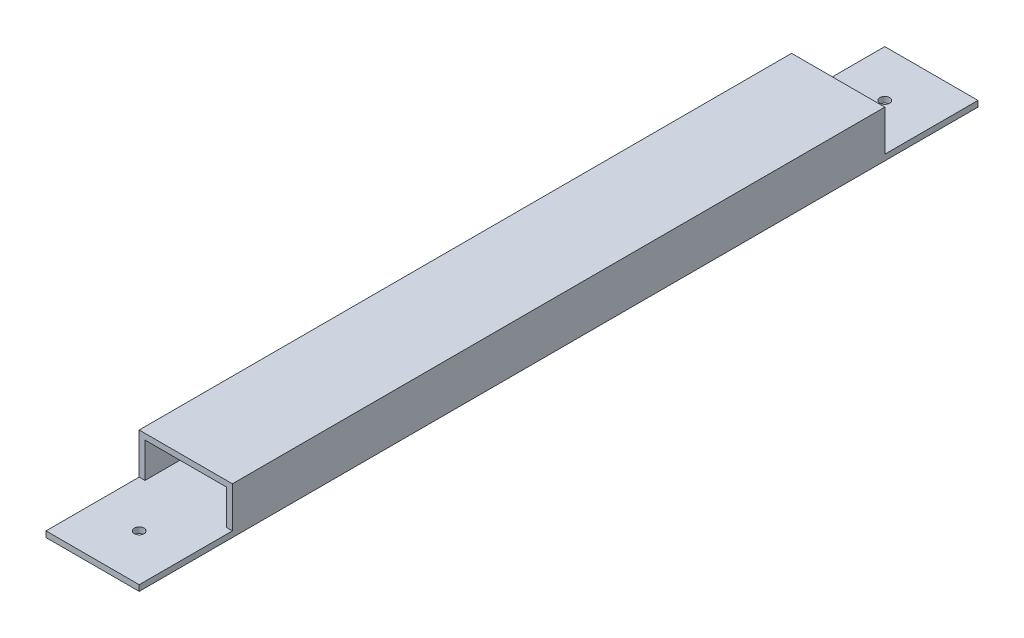
ISO-10303-21;
HEADER;
FILE_DESCRIPTION(('STEP AP214'),'2;1');
FILE_NAME('part.step','',(''),(''),'','','');
FILE_SCHEMA(('AUTOMOTIVE_DESIGN { 1 0 10303 214 1 1 1 1 }'));
ENDSEC;
DATA;
#1=APPLICATION_CONTEXT('core data for automotive mechanical design processes');
#2=APPLICATION_PROTOCOL_DEFINITION('international standard','automotive_design',2000,#1);
#3=PRODUCT_CONTEXT('',#1,'mechanical');
#4=PRODUCT('Part','Part','',(#3));
#5=PRODUCT_RELATED_PRODUCT_CATEGORY('part','',(#4));
#6=PRODUCT_DEFINITION_FORMATION('','',#4);
#7=PRODUCT_DEFINITION_CONTEXT('part definition',#1,'design');
#8=PRODUCT_DEFINITION('design','',#6,#7);
#9=PRODUCT_DEFINITION_SHAPE('','',#8);
#10=(LENGTH_UNIT() NAMED_UNIT(*) SI_UNIT(.MILLI.,.METRE.));
#11=(NAMED_UNIT(*) PLANE_ANGLE_UNIT() SI_UNIT($,.RADIAN.));
#12=(NAMED_UNIT(*) SI_UNIT($,.STERADIAN.) SOLID_ANGLE_UNIT());
#13=UNCERTAINTY_MEASURE_WITH_UNIT(LENGTH_MEASURE(1.E-05),#10,'distance_accuracy_value','');
#14=(GEOMETRIC_REPRESENTATION_CONTEXT(3) GLOBAL_UNCERTAINTY_ASSIGNED_CONTEXT((#13)) GLOBAL_UNIT_ASSIGNED_CONTEXT((#10,
#11,#12)) REPRESENTATION_CONTEXT('',''));
#15=CARTESIAN_POINT('',(0.,0.,0.));
#16=DIRECTION('',(0.,0.,1.));
#17=DIRECTION('',(1.,0.,0.));
#18=AXIS2_PLACEMENT_3D('',#15,#16,#17);
#19=CARTESIAN_POINT('',(0.,0.,457.2));
#20=DIRECTION('',(0.,0.,-1.));
#21=DIRECTION('',(-1.,0.,0.));
#22=AXIS2_PLACEMENT_3D('',#19,#20,#21);
#23=PLANE('',#22);
#24=DIRECTION('',(1.,0.,0.));
#25=VECTOR('',#24,1.);
#26=CARTESIAN_POINT('',(-22.225,-9.525,457.2));
#27=LINE('',#26,#25);
#28=CARTESIAN_POINT('',(-25.4,-9.52499999999999,457.2));
#29=VERTEX_POINT('',#28);
#30=CARTESIAN_POINT('',(25.4,-9.52499999999999,457.2));
#31=VERTEX_POINT('',#30);
#32=EDGE_CURVE('E219',#29,#31,#27,.T.);
#33=ORIENTED_EDGE('',*,*,#32,.F.);
#34=DIRECTION('',(0.,-1.,0.));
#35=VECTOR('',#34,1.);
#36=CARTESIAN_POINT('',(-25.4,-12.7,457.2));
#37=LINE('',#36,#35);
#38=CARTESIAN_POINT('',(-25.4,-12.7,457.2));
#39=VERTEX_POINT('',#38);
#40=EDGE_CURVE('E200',#29,#39,#37,.T.);
#41=ORIENTED_EDGE('',*,*,#40,.T.);
#42=DIRECTION('',(1.,0.,0.));
#43=VECTOR('',#42,1.);
#44=CARTESIAN_POINT('',(-25.4,-12.7,457.2));
#45=LINE('',#44,#43);
#46=CARTESIAN_POINT('',(25.4,-12.7,457.2));
#47=VERTEX_POINT('',#46);
#48=EDGE_CURVE('E186',#39,#47,#45,.T.);
#49=ORIENTED_EDGE('',*,*,#48,.T.);
#50=DIRECTION('',(0.,1.,0.));
#51=VECTOR('',#50,1.);
#52=CARTESIAN_POINT('',(25.4,-12.7,457.2));
#53=LINE('',#52,#51);
#54=EDGE_CURVE('E190',#47,#31,#53,.T.);
#55=ORIENTED_EDGE('',*,*,#54,.T.);
#56=EDGE_LOOP('',(#33,#41,#49,#55));
#57=FACE_BOUND('',#56,.T.);
#58=ADVANCED_FACE('F38',(#57),#23,.F.);
#59=CARTESIAN_POINT('',(0.,0.,0.));
#60=DIRECTION('',(0.,0.,-1.));
#61=DIRECTION('',(-1.,0.,0.));
#62=AXIS2_PLACEMENT_3D('',#59,#60,#61);
#63=PLANE('',#62);
#64=DIRECTION('',(0.,-1.,0.));
#65=VECTOR('',#64,1.);
#66=CARTESIAN_POINT('',(-25.4,-12.7,0.));
#67=LINE('',#66,#65);
#68=CARTESIAN_POINT('',(-25.4,-9.52499999999999,0.));
#69=VERTEX_POINT('',#68);
#70=CARTESIAN_POINT('',(-25.4,-12.7,0.));
#71=VERTEX_POINT('',#70);
#72=EDGE_CURVE('E191',#69,#71,#67,.T.);
#73=ORIENTED_EDGE('',*,*,#72,.F.);
#74=DIRECTION('',(1.,0.,0.));
#75=VECTOR('',#74,1.);
#76=CARTESIAN_POINT('',(-22.225,-9.525,0.));
#77=LINE('',#76,#75);
#78=CARTESIAN_POINT('',(25.4,-9.52499999999999,0.));
#79=VERTEX_POINT('',#78);
#80=EDGE_CURVE('E220',#69,#79,#77,.T.);
#81=ORIENTED_EDGE('',*,*,#80,.T.);
#82=DIRECTION('',(0.,1.,0.));
#83=VECTOR('',#82,1.);
#84=CARTESIAN_POINT('',(25.4,-12.7,0.));
#85=LINE('',#84,#83);
#86=CARTESIAN_POINT('',(25.4,-12.7,0.));
#87=VERTEX_POINT('',#86);
#88=EDGE_CURVE('E194',#87,#79,#85,.T.);
#89=ORIENTED_EDGE('',*,*,#88,.F.);
#90=DIRECTION('',(1.,0.,0.));
#91=VECTOR('',#90,1.);
#92=CARTESIAN_POINT('',(-25.4,-12.7,0.));
#93=LINE('',#92,#91);
#94=EDGE_CURVE('E187',#71,#87,#93,.T.);
#95=ORIENTED_EDGE('',*,*,#94,.F.);
#96=EDGE_LOOP('',(#73,#81,#89,#95));
#97=FACE_BOUND('',#96,.T.);
#98=ADVANCED_FACE('F285',(#97),#63,.T.);
#99=CARTESIAN_POINT('',(25.4,-12.7,457.2));
#100=DIRECTION('',(-1.,0.,0.));
#101=DIRECTION('',(0.,0.,1.));
#102=AXIS2_PLACEMENT_3D('',#99,#100,#101);
#103=PLANE('',#102);
#104=DIRECTION('',(0.,0.,-1.));
#105=VECTOR('',#104,1.);
#106=CARTESIAN_POINT('',(25.4,12.7,457.2));
#107=LINE('',#106,#105);
#108=CARTESIAN_POINT('',(25.4,12.7,406.4));
#109=VERTEX_POINT('',#108);
#110=CARTESIAN_POINT('',(25.4,12.7,50.8));
#111=VERTEX_POINT('',#110);
#112=EDGE_CURVE('E161',#109,#111,#107,.T.);
#113=ORIENTED_EDGE('',*,*,#112,.F.);
#114=DIRECTION('',(0.,1.,0.));
#115=VECTOR('',#114,1.);
#116=CARTESIAN_POINT('',(25.4,-81.3670489685532,406.4));
#117=LINE('',#116,#115);
#118=CARTESIAN_POINT('',(25.4,-9.52499999999999,406.4));
#119=VERTEX_POINT('',#118);
#120=EDGE_CURVE('E141',#119,#109,#117,.T.);
#121=ORIENTED_EDGE('',*,*,#120,.F.);
#122=DIRECTION('',(0.,0.,1.));
#123=VECTOR('',#122,1.);
#124=CARTESIAN_POINT('',(25.4,-9.52499999999999,457.2));
#125=LINE('',#124,#123);
#126=EDGE_CURVE('E264',#119,#31,#125,.T.);
#127=ORIENTED_EDGE('',*,*,#126,.T.);
#128=ORIENTED_EDGE('',*,*,#54,.F.);
#129=DIRECTION('',(0.,0.,-1.));
#130=VECTOR('',#129,1.);
#131=CARTESIAN_POINT('',(25.4,-12.7,457.2));
#132=LINE('',#131,#130);
#133=EDGE_CURVE('E182',#47,#87,#132,.T.);
#134=ORIENTED_EDGE('',*,*,#133,.T.);
#135=ORIENTED_EDGE('',*,*,#88,.T.);
#136=DIRECTION('',(0.,0.,1.));
#137=VECTOR('',#136,1.);
#138=CARTESIAN_POINT('',(25.4,-9.52499999999999,0.));
#139=LINE('',#138,#137);
#140=CARTESIAN_POINT('',(25.4,-9.52499999999999,50.8));
#141=VERTEX_POINT('',#140);
#142=EDGE_CURVE('E255',#79,#141,#139,.T.);
#143=ORIENTED_EDGE('',*,*,#142,.T.);
#144=DIRECTION('',(0.,1.,0.));
#145=VECTOR('',#144,1.);
#146=CARTESIAN_POINT('',(25.4,-81.3670489685532,50.8));
#147=LINE('',#146,#145);
#148=EDGE_CURVE('E169',#141,#111,#147,.T.);
#149=ORIENTED_EDGE('',*,*,#148,.T.);
#150=EDGE_LOOP('',(#113,#121,#127,#128,#134,#135,#143,#149));
#151=FACE_BOUND('',#150,.T.);
#152=ADVANCED_FACE('F40',(#151),#103,.F.);
#153=CARTESIAN_POINT('',(-25.4,12.7,457.2));
#154=DIRECTION('',(0.,-1.,0.));
#155=DIRECTION('',(0.,0.,-1.));
#156=AXIS2_PLACEMENT_3D('',#153,#154,#155);
#157=PLANE('',#156);
#158=DIRECTION('',(0.,0.,-1.));
#159=VECTOR('',#158,1.);
#160=CARTESIAN_POINT('',(-25.4,12.7,457.2));
#161=LINE('',#160,#159);
#162=CARTESIAN_POINT('',(-25.4,12.7,406.4));
#163=VERTEX_POINT('',#162);
#164=CARTESIAN_POINT('',(-25.4,12.7,50.8));
#165=VERTEX_POINT('',#164);
#166=EDGE_CURVE('E163',#163,#165,#161,.T.);
#167=ORIENTED_EDGE('',*,*,#166,.F.);
#168=DIRECTION('',(-1.,0.,0.));
#169=VECTOR('',#168,1.);
#170=CARTESIAN_POINT('',(-25.4,12.7,406.4));
#171=LINE('',#170,#169);
#172=EDGE_CURVE('E145',#109,#163,#171,.T.);
#173=ORIENTED_EDGE('',*,*,#172,.F.);
#174=ORIENTED_EDGE('',*,*,#112,.T.);
#175=DIRECTION('',(1.,0.,0.));
#176=VECTOR('',#175,1.);
#177=CARTESIAN_POINT('',(-25.4,12.7,50.8));
#178=LINE('',#177,#176);
#179=EDGE_CURVE('E253',#165,#111,#178,.T.);
#180=ORIENTED_EDGE('',*,*,#179,.F.);
#181=EDGE_LOOP('',(#167,#173,#174,#180));
#182=FACE_BOUND('',#181,.T.);
#183=ADVANCED_FACE('F159',(#182),#157,.F.);
#184=CARTESIAN_POINT('',(-25.4,-12.7,457.2));
#185=DIRECTION('',(1.,0.,0.));
#186=DIRECTION('',(0.,0.,-1.));
#187=AXIS2_PLACEMENT_3D('',#184,#185,#186);
#188=PLANE('',#187);
#189=DIRECTION('',(0.,0.,-1.));
#190=VECTOR('',#189,1.);
#191=CARTESIAN_POINT('',(-25.4,-9.52499999999999,457.2));
#192=LINE('',#191,#190);
#193=CARTESIAN_POINT('',(-25.4,-9.52499999999999,406.4));
#194=VERTEX_POINT('',#193);
#195=EDGE_CURVE('E246',#29,#194,#192,.T.);
#196=ORIENTED_EDGE('',*,*,#195,.T.);
#197=DIRECTION('',(0.,1.,0.));
#198=VECTOR('',#197,1.);
#199=CARTESIAN_POINT('',(-25.4,-81.3670489685532,406.4));
#200=LINE('',#199,#198);
#201=EDGE_CURVE('E154',#194,#163,#200,.T.);
#202=ORIENTED_EDGE('',*,*,#201,.T.);
#203=ORIENTED_EDGE('',*,*,#166,.T.);
#204=DIRECTION('',(0.,1.,0.));
#205=VECTOR('',#204,1.);
#206=CARTESIAN_POINT('',(-25.4,-81.3670489685532,50.8));
#207=LINE('',#206,#205);
#208=CARTESIAN_POINT('',(-25.4,-9.52499999999999,50.8));
#209=VERTEX_POINT('',#208);
#210=EDGE_CURVE('E250',#209,#165,#207,.T.);
#211=ORIENTED_EDGE('',*,*,#210,.F.);
#212=DIRECTION('',(0.,0.,-1.));
#213=VECTOR('',#212,1.);
#214=CARTESIAN_POINT('',(-25.4,-9.52499999999999,0.));
#215=LINE('',#214,#213);
#216=EDGE_CURVE('E258',#209,#69,#215,.T.);
#217=ORIENTED_EDGE('',*,*,#216,.T.);
#218=ORIENTED_EDGE('',*,*,#72,.T.);
#219=DIRECTION('',(0.,0.,-1.));
#220=VECTOR('',#219,1.);
#221=CARTESIAN_POINT('',(-25.4,-12.7,457.2));
#222=LINE('',#221,#220);
#223=EDGE_CURVE('E176',#39,#71,#222,.T.);
#224=ORIENTED_EDGE('',*,*,#223,.F.);
#225=ORIENTED_EDGE('',*,*,#40,.F.);
#226=EDGE_LOOP('',(#196,#202,#203,#211,#217,#218,#224,#225));
#227=FACE_BOUND('',#226,.T.);
#228=ADVANCED_FACE('F308',(#227),#188,.F.);
#229=CARTESIAN_POINT('',(-25.4,-12.7,457.2));
#230=DIRECTION('',(0.,1.,0.));
#231=DIRECTION('',(-1.,0.,0.));
#232=AXIS2_PLACEMENT_3D('',#229,#230,#231);
#233=PLANE('',#232);
#234=CARTESIAN_POINT('',(0.,-12.7,431.8));
#235=DIRECTION('',(0.,1.,0.));
#236=DIRECTION('',(0.,0.,1.));
#237=AXIS2_PLACEMENT_3D('',#234,#235,#236);
#238=CIRCLE('',#237,2.667);
#239=CARTESIAN_POINT('',(0.,-12.7,434.467));
#240=VERTEX_POINT('',#239);
#241=EDGE_CURVE('E231',#240,#240,#238,.T.);
#242=ORIENTED_EDGE('',*,*,#241,.T.);
#243=EDGE_LOOP('',(#242));
#244=FACE_BOUND('',#243,.T.);
#245=CARTESIAN_POINT('',(0.,-12.7,25.4));
#246=DIRECTION('',(0.,1.,0.));
#247=DIRECTION('',(0.,0.,1.));
#248=AXIS2_PLACEMENT_3D('',#245,#246,#247);
#249=CIRCLE('',#248,2.667);
#250=CARTESIAN_POINT('',(0.,-12.7,28.067));
#251=VERTEX_POINT('',#250);
#252=EDGE_CURVE('E232',#251,#251,#249,.T.);
#253=ORIENTED_EDGE('',*,*,#252,.T.);
#254=EDGE_LOOP('',(#253));
#255=FACE_BOUND('',#254,.T.);
#256=ORIENTED_EDGE('',*,*,#94,.T.);
#257=ORIENTED_EDGE('',*,*,#133,.F.);
#258=ORIENTED_EDGE('',*,*,#48,.F.);
#259=ORIENTED_EDGE('',*,*,#223,.T.);
#260=EDGE_LOOP('',(#256,#257,#258,#259));
#261=FACE_BOUND('',#260,.T.);
#262=ADVANCED_FACE('F280',(#244,#255,#261),#233,.F.);
#263=CARTESIAN_POINT('',(-22.225,-9.525,457.2));
#264=DIRECTION('',(1.,0.,0.));
#265=DIRECTION('',(0.,0.,-1.));
#266=AXIS2_PLACEMENT_3D('',#263,#264,#265);
#267=PLANE('',#266);
#268=DIRECTION('',(0.,1.,0.));
#269=VECTOR('',#268,1.);
#270=CARTESIAN_POINT('',(-22.225,-9.525,406.4));
#271=LINE('',#270,#269);
#272=CARTESIAN_POINT('',(-22.225,-9.52499999999999,406.4));
#273=VERTEX_POINT('',#272);
#274=CARTESIAN_POINT('',(-22.225,9.525,406.4));
#275=VERTEX_POINT('',#274);
#276=EDGE_CURVE('E53',#273,#275,#271,.T.);
#277=ORIENTED_EDGE('',*,*,#276,.F.);
#278=DIRECTION('',(0.,0.,-1.));
#279=VECTOR('',#278,1.);
#280=CARTESIAN_POINT('',(-22.225,-9.525,457.2));
#281=LINE('',#280,#279);
#282=CARTESIAN_POINT('',(-22.225,-9.52499999999999,50.8));
#283=VERTEX_POINT('',#282);
#284=EDGE_CURVE('E198',#273,#283,#281,.T.);
#285=ORIENTED_EDGE('',*,*,#284,.T.);
#286=DIRECTION('',(0.,-1.,0.));
#287=VECTOR('',#286,1.);
#288=CARTESIAN_POINT('',(-22.225,-9.525,50.8));
#289=LINE('',#288,#287);
#290=CARTESIAN_POINT('',(-22.225,9.525,50.8));
#291=VERTEX_POINT('',#290);
#292=EDGE_CURVE('E242',#291,#283,#289,.T.);
#293=ORIENTED_EDGE('',*,*,#292,.F.);
#294=DIRECTION('',(0.,0.,-1.));
#295=VECTOR('',#294,1.);
#296=CARTESIAN_POINT('',(-22.225,9.525,457.2));
#297=LINE('',#296,#295);
#298=EDGE_CURVE('E215',#275,#291,#297,.T.);
#299=ORIENTED_EDGE('',*,*,#298,.F.);
#300=EDGE_LOOP('',(#277,#285,#293,#299));
#301=FACE_BOUND('',#300,.T.);
#302=ADVANCED_FACE('F304',(#301),#267,.T.);
#303=CARTESIAN_POINT('',(-22.225,-9.525,457.2));
#304=DIRECTION('',(0.,1.,0.));
#305=DIRECTION('',(0.,0.,1.));
#306=AXIS2_PLACEMENT_3D('',#303,#304,#305);
#307=PLANE('',#306);
#308=ORIENTED_EDGE('',*,*,#284,.F.);
#309=DIRECTION('',(1.,0.,0.));
#310=VECTOR('',#309,1.);
#311=CARTESIAN_POINT('',(-25.4,-9.52499999999999,406.4));
#312=LINE('',#311,#310);
#313=EDGE_CURVE('E268',#194,#273,#312,.T.);
#314=ORIENTED_EDGE('',*,*,#313,.F.);
#315=ORIENTED_EDGE('',*,*,#195,.F.);
#316=ORIENTED_EDGE('',*,*,#32,.T.);
#317=ORIENTED_EDGE('',*,*,#126,.F.);
#318=CARTESIAN_POINT('',(22.225,-9.52499999999999,406.4));
#319=VERTEX_POINT('',#318);
#320=EDGE_CURVE('E148',#319,#119,#312,.T.);
#321=ORIENTED_EDGE('',*,*,#320,.F.);
#322=DIRECTION('',(0.,0.,-1.));
#323=VECTOR('',#322,1.);
#324=CARTESIAN_POINT('',(22.225,-9.525,457.2));
#325=LINE('',#324,#323);
#326=CARTESIAN_POINT('',(22.225,-9.52499999999999,50.8));
#327=VERTEX_POINT('',#326);
#328=EDGE_CURVE('E207',#319,#327,#325,.T.);
#329=ORIENTED_EDGE('',*,*,#328,.T.);
#330=DIRECTION('',(-1.,0.,0.));
#331=VECTOR('',#330,1.);
#332=CARTESIAN_POINT('',(-25.4,-9.52499999999999,50.8));
#333=LINE('',#332,#331);
#334=EDGE_CURVE('E165',#141,#327,#333,.T.);
#335=ORIENTED_EDGE('',*,*,#334,.F.);
#336=ORIENTED_EDGE('',*,*,#142,.F.);
#337=ORIENTED_EDGE('',*,*,#80,.F.);
#338=ORIENTED_EDGE('',*,*,#216,.F.);
#339=EDGE_CURVE('E249',#283,#209,#333,.T.);
#340=ORIENTED_EDGE('',*,*,#339,.F.);
#341=EDGE_LOOP('',(#308,#314,#315,#316,#317,#321,#329,#335,#336,#337,#338,#340));
#342=FACE_BOUND('',#341,.T.);
#343=CARTESIAN_POINT('',(0.,-9.525,25.4));
#344=DIRECTION('',(0.,1.,0.));
#345=DIRECTION('',(0.,0.,1.));
#346=AXIS2_PLACEMENT_3D('',#343,#344,#345);
#347=CIRCLE('',#346,2.667);
#348=CARTESIAN_POINT('',(0.,-9.525,28.067));
#349=VERTEX_POINT('',#348);
#350=EDGE_CURVE('E227',#349,#349,#347,.T.);
#351=ORIENTED_EDGE('',*,*,#350,.F.);
#352=EDGE_LOOP('',(#351));
#353=FACE_BOUND('',#352,.T.);
#354=CARTESIAN_POINT('',(0.,-9.525,431.8));
#355=DIRECTION('',(0.,1.,0.));
#356=DIRECTION('',(0.,0.,1.));
#357=AXIS2_PLACEMENT_3D('',#354,#355,#356);
#358=CIRCLE('',#357,2.667);
#359=CARTESIAN_POINT('',(0.,-9.525,434.467));
#360=VERTEX_POINT('',#359);
#361=EDGE_CURVE('E223',#360,#360,#358,.T.);
#362=ORIENTED_EDGE('',*,*,#361,.F.);
#363=EDGE_LOOP('',(#362));
#364=FACE_BOUND('',#363,.T.);
#365=ADVANCED_FACE('F290',(#342,#353,#364),#307,.T.);
#366=CARTESIAN_POINT('',(22.225,-9.525,457.2));
#367=DIRECTION('',(-1.,0.,0.));
#368=DIRECTION('',(0.,-1.,0.));
#369=AXIS2_PLACEMENT_3D('',#366,#367,#368);
#370=PLANE('',#369);
#371=DIRECTION('',(0.,-1.,0.));
#372=VECTOR('',#371,1.);
#373=CARTESIAN_POINT('',(22.225,-9.525,406.4));
#374=LINE('',#373,#372);
#375=CARTESIAN_POINT('',(22.225,9.525,406.4));
#376=VERTEX_POINT('',#375);
#377=EDGE_CURVE('E239',#376,#319,#374,.T.);
#378=ORIENTED_EDGE('',*,*,#377,.F.);
#379=DIRECTION('',(0.,0.,-1.));
#380=VECTOR('',#379,1.);
#381=CARTESIAN_POINT('',(22.225,9.525,457.2));
#382=LINE('',#381,#380);
#383=CARTESIAN_POINT('',(22.225,9.525,50.8));
#384=VERTEX_POINT('',#383);
#385=EDGE_CURVE('E211',#376,#384,#382,.T.);
#386=ORIENTED_EDGE('',*,*,#385,.T.);
#387=DIRECTION('',(0.,1.,0.));
#388=VECTOR('',#387,1.);
#389=CARTESIAN_POINT('',(22.225,-9.525,50.8));
#390=LINE('',#389,#388);
#391=EDGE_CURVE('E64',#327,#384,#390,.T.);
#392=ORIENTED_EDGE('',*,*,#391,.F.);
#393=ORIENTED_EDGE('',*,*,#328,.F.);
#394=EDGE_LOOP('',(#378,#386,#392,#393));
#395=FACE_BOUND('',#394,.T.);
#396=ADVANCED_FACE('F296',(#395),#370,.T.);
#397=CARTESIAN_POINT('',(-22.225,9.525,457.2));
#398=DIRECTION('',(0.,-1.,0.));
#399=DIRECTION('',(0.,0.,-1.));
#400=AXIS2_PLACEMENT_3D('',#397,#398,#399);
#401=PLANE('',#400);
#402=DIRECTION('',(1.,0.,0.));
#403=VECTOR('',#402,1.);
#404=CARTESIAN_POINT('',(-22.225,9.525,406.4));
#405=LINE('',#404,#403);
#406=EDGE_CURVE('E11',#275,#376,#405,.T.);
#407=ORIENTED_EDGE('',*,*,#406,.F.);
#408=ORIENTED_EDGE('',*,*,#298,.T.);
#409=DIRECTION('',(-1.,0.,0.));
#410=VECTOR('',#409,1.);
#411=CARTESIAN_POINT('',(-22.225,9.525,50.8));
#412=LINE('',#411,#410);
#413=EDGE_CURVE('E47',#384,#291,#412,.T.);
#414=ORIENTED_EDGE('',*,*,#413,.F.);
#415=ORIENTED_EDGE('',*,*,#385,.F.);
#416=EDGE_LOOP('',(#407,#408,#414,#415));
#417=FACE_BOUND('',#416,.T.);
#418=ADVANCED_FACE('F299',(#417),#401,.T.);
#419=CARTESIAN_POINT('',(0.,-12.7,25.4));
#420=DIRECTION('',(0.,1.,0.));
#421=DIRECTION('',(0.,0.,1.));
#422=AXIS2_PLACEMENT_3D('',#419,#420,#421);
#423=CYLINDRICAL_SURFACE('',#422,2.667);
#424=ORIENTED_EDGE('',*,*,#350,.T.);
#425=EDGE_LOOP('',(#424));
#426=FACE_BOUND('',#425,.T.);
#427=ORIENTED_EDGE('',*,*,#252,.F.);
#428=EDGE_LOOP('',(#427));
#429=FACE_BOUND('',#428,.T.);
#430=ADVANCED_FACE('F332',(#426,#429),#423,.F.);
#431=CARTESIAN_POINT('',(0.,-12.7,431.8));
#432=DIRECTION('',(0.,1.,0.));
#433=DIRECTION('',(0.,0.,1.));
#434=AXIS2_PLACEMENT_3D('',#431,#432,#433);
#435=CYLINDRICAL_SURFACE('',#434,2.667);
#436=ORIENTED_EDGE('',*,*,#361,.T.);
#437=EDGE_LOOP('',(#436));
#438=FACE_BOUND('',#437,.T.);
#439=ORIENTED_EDGE('',*,*,#241,.F.);
#440=EDGE_LOOP('',(#439));
#441=FACE_BOUND('',#440,.T.);
#442=ADVANCED_FACE('F335',(#438,#441),#435,.F.);
#443=CARTESIAN_POINT('',(-25.4,-81.3670489685532,50.8));
#444=DIRECTION('',(0.,0.,1.));
#445=DIRECTION('',(1.,0.,0.));
#446=AXIS2_PLACEMENT_3D('',#443,#444,#445);
#447=PLANE('',#446);
#448=ORIENTED_EDGE('',*,*,#292,.T.);
#449=ORIENTED_EDGE('',*,*,#339,.T.);
#450=ORIENTED_EDGE('',*,*,#210,.T.);
#451=ORIENTED_EDGE('',*,*,#179,.T.);
#452=ORIENTED_EDGE('',*,*,#148,.F.);
#453=ORIENTED_EDGE('',*,*,#334,.T.);
#454=ORIENTED_EDGE('',*,*,#391,.T.);
#455=ORIENTED_EDGE('',*,*,#413,.T.);
#456=EDGE_LOOP('',(#448,#449,#450,#451,#452,#453,#454,#455));
#457=FACE_BOUND('',#456,.T.);
#458=ADVANCED_FACE('F293',(#457),#447,.F.);
#459=CARTESIAN_POINT('',(-25.4,-81.3670489685532,406.4));
#460=DIRECTION('',(0.,0.,-1.));
#461=DIRECTION('',(-1.,0.,0.));
#462=AXIS2_PLACEMENT_3D('',#459,#460,#461);
#463=PLANE('',#462);
#464=ORIENTED_EDGE('',*,*,#276,.T.);
#465=ORIENTED_EDGE('',*,*,#406,.T.);
#466=ORIENTED_EDGE('',*,*,#377,.T.);
#467=ORIENTED_EDGE('',*,*,#320,.T.);
#468=ORIENTED_EDGE('',*,*,#120,.T.);
#469=ORIENTED_EDGE('',*,*,#172,.T.);
#470=ORIENTED_EDGE('',*,*,#201,.F.);
#471=ORIENTED_EDGE('',*,*,#313,.T.);
#472=EDGE_LOOP('',(#464,#465,#466,#467,#468,#469,#470,#471));
#473=FACE_BOUND('',#472,.T.);
#474=ADVANCED_FACE('F143',(#473),#463,.F.);
#475=CLOSED_SHELL('',(#58,#98,#152,#183,#228,#262,#302,#365,#396,#418,#430,#442,#458,#474));
#476=MANIFOLD_SOLID_BREP('B2',#475);
#477=ADVANCED_BREP_SHAPE_REPRESENTATION('',(#18,#476),#14);
#478=SHAPE_DEFINITION_REPRESENTATION(#9,#477);
ENDSEC;
END-ISO-10303-21;
